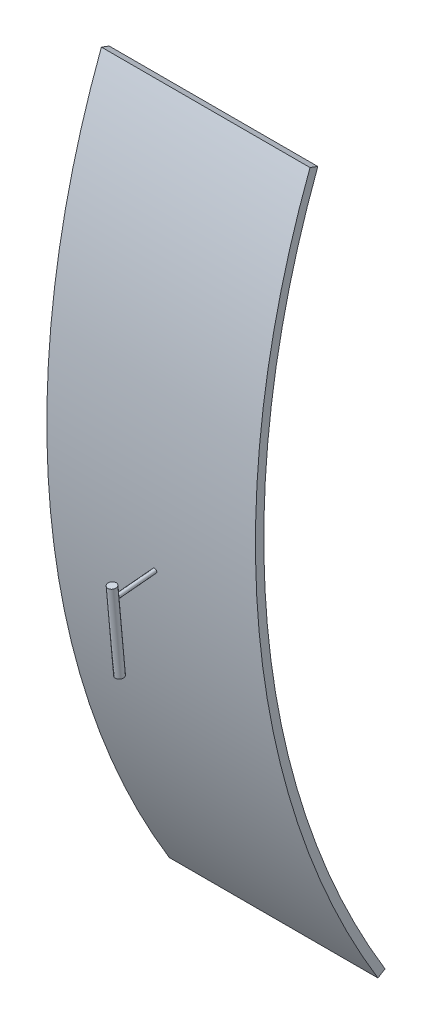
ISO-10303-21;
HEADER;
FILE_DESCRIPTION(('STEP AP214'),'2;1');
FILE_NAME('part.step','',(''),(''),'','','');
FILE_SCHEMA(('AUTOMOTIVE_DESIGN { 1 0 10303 214 1 1 1 1 }'));
ENDSEC;
DATA;
#1=APPLICATION_CONTEXT('core data for automotive mechanical design processes');
#2=APPLICATION_PROTOCOL_DEFINITION('international standard','automotive_design',2000,#1);
#3=PRODUCT_CONTEXT('',#1,'mechanical');
#4=PRODUCT('Part','Part','',(#3));
#5=PRODUCT_RELATED_PRODUCT_CATEGORY('part','',(#4));
#6=PRODUCT_DEFINITION_FORMATION('','',#4);
#7=PRODUCT_DEFINITION_CONTEXT('part definition',#1,'design');
#8=PRODUCT_DEFINITION('design','',#6,#7);
#9=PRODUCT_DEFINITION_SHAPE('','',#8);
#10=(LENGTH_UNIT() NAMED_UNIT(*) SI_UNIT(.MILLI.,.METRE.));
#11=(NAMED_UNIT(*) PLANE_ANGLE_UNIT() SI_UNIT($,.RADIAN.));
#12=(NAMED_UNIT(*) SI_UNIT($,.STERADIAN.) SOLID_ANGLE_UNIT());
#13=UNCERTAINTY_MEASURE_WITH_UNIT(LENGTH_MEASURE(1.E-05),#10,'distance_accuracy_value','');
#14=(GEOMETRIC_REPRESENTATION_CONTEXT(3) GLOBAL_UNCERTAINTY_ASSIGNED_CONTEXT((#13)) GLOBAL_UNIT_ASSIGNED_CONTEXT((#10,
#11,#12)) REPRESENTATION_CONTEXT('',''));
#15=CARTESIAN_POINT('',(0.,0.,0.));
#16=DIRECTION('',(0.,0.,1.));
#17=DIRECTION('',(1.,0.,0.));
#18=AXIS2_PLACEMENT_3D('',#15,#16,#17);
#19=CARTESIAN_POINT('',(25.,-36.1186263978189,209.567543008368));
#20=DIRECTION('',(0.,0.995768271147237,0.091899674517612));
#21=DIRECTION('',(0.,-0.091899674517612,0.995768271147237));
#22=AXIS2_PLACEMENT_3D('',#19,#20,#21);
#23=PLANE('',#22);
#24=CARTESIAN_POINT('',(25.,-36.1186263978189,209.567543008368));
#25=DIRECTION('',(0.,0.995768271147237,0.091899674517612));
#26=DIRECTION('',(0.,-0.091899674517612,0.995768271147237));
#27=AXIS2_PLACEMENT_3D('',#24,#25,#26);
#28=CIRCLE('',#27,1.);
#29=CARTESIAN_POINT('',(25.,-36.2105260723365,210.563311279516));
#30=VERTEX_POINT('',#29);
#31=EDGE_CURVE('E11',#30,#30,#28,.T.);
#32=ORIENTED_EDGE('',*,*,#31,.F.);
#33=EDGE_LOOP('',(#32));
#34=FACE_BOUND('',#33,.T.);
#35=ADVANCED_FACE('F40',(#34),#23,.F.);
#36=CARTESIAN_POINT('',(25.,-16.5421652830418,211.374258944981));
#37=DIRECTION('',(0.,0.995768271147237,0.091899674517612));
#38=DIRECTION('',(0.,-0.091899674517612,0.995768271147237));
#39=AXIS2_PLACEMENT_3D('',#36,#37,#38);
#40=CYLINDRICAL_SURFACE('',#39,0.999999999999999);
#41=CARTESIAN_POINT('',(25.,-16.5421652830418,211.374258944981));
#42=DIRECTION('',(0.,0.995768271147237,0.091899674517612));
#43=DIRECTION('',(0.,-0.091899674517612,0.995768271147237));
#44=AXIS2_PLACEMENT_3D('',#41,#42,#43);
#45=CIRCLE('',#44,0.999999999999998);
#46=CARTESIAN_POINT('',(25.,-16.6340649575594,212.370027216128));
#47=VERTEX_POINT('',#46);
#48=EDGE_CURVE('E46',#47,#47,#45,.T.);
#49=ORIENTED_EDGE('',*,*,#48,.F.);
#50=EDGE_LOOP('',(#49));
#51=FACE_BOUND('',#50,.T.);
#52=ORIENTED_EDGE('',*,*,#31,.T.);
#53=EDGE_LOOP('',(#52));
#54=FACE_BOUND('',#53,.T.);
#55=ADVANCED_FACE('F54',(#51,#54),#40,.T.);
#56=CARTESIAN_POINT('',(25.,-16.5421652830418,211.374258944981));
#57=DIRECTION('',(0.,-0.995768271147237,-0.091899674517612));
#58=DIRECTION('',(0.,0.091899674517612,-0.995768271147237));
#59=AXIS2_PLACEMENT_3D('',#56,#57,#58);
#60=PLANE('',#59);
#61=ORIENTED_EDGE('',*,*,#48,.T.);
#62=EDGE_LOOP('',(#61));
#63=FACE_BOUND('',#62,.T.);
#64=ADVANCED_FACE('F52',(#63),#60,.F.);
#65=CLOSED_SHELL('',(#35,#55,#64));
#66=MANIFOLD_SOLID_BREP('B2',#65);
#67=CARTESIAN_POINT('',(25.,-19.4827309977337,211.102873483214));
#68=DIRECTION('',(0.,0.0918996745176121,-0.995768271147237));
#69=DIRECTION('',(0.,0.995768271147237,0.0918996745176121));
#70=AXIS2_PLACEMENT_3D('',#67,#68,#69);
#71=CYLINDRICAL_SURFACE('',#70,0.5);
#72=CARTESIAN_POINT('',(25.,-19.4827309977337,211.102873483214));
#73=DIRECTION('',(0.,-0.0918996745176121,0.995768271147237));
#74=DIRECTION('',(0.,-0.995768271147237,-0.0918996745176121));
#75=AXIS2_PLACEMENT_3D('',#72,#73,#74);
#76=CIRCLE('',#75,0.5);
#77=CARTESIAN_POINT('',(25.,-19.9806151333073,211.056923645955));
#78=VERTEX_POINT('',#77);
#79=EDGE_CURVE('E39',#78,#78,#76,.T.);
#80=ORIENTED_EDGE('',*,*,#79,.F.);
#81=EDGE_LOOP('',(#80));
#82=FACE_BOUND('',#81,.T.);
#83=CARTESIAN_POINT('',(25.,-18.5637342525576,201.145190771742));
#84=DIRECTION('',(0.,-0.0918996745176121,0.995768271147237));
#85=DIRECTION('',(0.,-0.995768271147237,-0.0918996745176121));
#86=AXIS2_PLACEMENT_3D('',#83,#84,#85);
#87=CIRCLE('',#86,0.5);
#88=CARTESIAN_POINT('',(25.,-19.0616183881312,201.099240934483));
#89=VERTEX_POINT('',#88);
#90=EDGE_CURVE('E93',#89,#89,#87,.T.);
#91=ORIENTED_EDGE('',*,*,#90,.T.);
#92=EDGE_LOOP('',(#91));
#93=FACE_BOUND('',#92,.T.);
#94=ADVANCED_FACE('F90',(#82,#93),#71,.T.);
#95=CARTESIAN_POINT('',(25.,-19.4827309977337,211.102873483214));
#96=DIRECTION('',(0.,-0.0918996745176121,0.995768271147237));
#97=DIRECTION('',(0.,-0.995768271147237,-0.0918996745176121));
#98=AXIS2_PLACEMENT_3D('',#95,#96,#97);
#99=PLANE('',#98);
#100=ORIENTED_EDGE('',*,*,#79,.T.);
#101=EDGE_LOOP('',(#100));
#102=FACE_BOUND('',#101,.T.);
#103=ADVANCED_FACE('F105',(#102),#99,.T.);
#104=CARTESIAN_POINT('',(25.,-18.5637342525576,201.145190771742));
#105=DIRECTION('',(0.,-0.0918996745176121,0.995768271147237));
#106=DIRECTION('',(0.,-0.995768271147237,-0.0918996745176121));
#107=AXIS2_PLACEMENT_3D('',#104,#105,#106);
#108=PLANE('',#107);
#109=ORIENTED_EDGE('',*,*,#90,.F.);
#110=EDGE_LOOP('',(#109));
#111=FACE_BOUND('',#110,.T.);
#112=ADVANCED_FACE('F103',(#111),#108,.F.);
#113=CLOSED_SHELL('',(#94,#103,#112));
#114=MANIFOLD_SOLID_BREP('B6',#113);
#115=CARTESIAN_POINT('',(50.,0.,0.));
#116=DIRECTION('',(-1.,0.,0.));
#117=DIRECTION('',(0.,0.,1.));
#118=AXIS2_PLACEMENT_3D('',#115,#116,#117);
#119=CYLINDRICAL_SURFACE('',#118,200.);
#120=CARTESIAN_POINT('',(0.,0.,0.));
#121=DIRECTION('',(1.,0.,0.));
#122=DIRECTION('',(0.,0.,-1.));
#123=AXIS2_PLACEMENT_3D('',#120,#121,#122);
#124=CIRCLE('',#123,200.);
#125=CARTESIAN_POINT('',(0.,70.7834397291449,187.055351861716));
#126=VERTEX_POINT('',#125);
#127=CARTESIAN_POINT('',(0.,-103.822991854449,170.940885578585));
#128=VERTEX_POINT('',#127);
#129=EDGE_CURVE('E194',#126,#128,#124,.T.);
#130=ORIENTED_EDGE('',*,*,#129,.F.);
#131=DIRECTION('',(-1.,0.,0.));
#132=VECTOR('',#131,1.);
#133=CARTESIAN_POINT('',(50.,70.7834397291449,187.055351861716));
#134=LINE('',#133,#132);
#135=CARTESIAN_POINT('',(50.,70.7834397291449,187.055351861716));
#136=VERTEX_POINT('',#135);
#137=EDGE_CURVE('E88',#136,#126,#134,.T.);
#138=ORIENTED_EDGE('',*,*,#137,.F.);
#139=CARTESIAN_POINT('',(50.,0.,0.));
#140=DIRECTION('',(1.,0.,0.));
#141=DIRECTION('',(0.,0.,-1.));
#142=AXIS2_PLACEMENT_3D('',#139,#140,#141);
#143=CIRCLE('',#142,200.);
#144=CARTESIAN_POINT('',(50.,-103.822991854449,170.940885578585));
#145=VERTEX_POINT('',#144);
#146=EDGE_CURVE('E186',#136,#145,#143,.T.);
#147=ORIENTED_EDGE('',*,*,#146,.T.);
#148=DIRECTION('',(-1.,0.,0.));
#149=VECTOR('',#148,1.);
#150=CARTESIAN_POINT('',(50.,-103.822991854449,170.940885578585));
#151=LINE('',#150,#149);
#152=EDGE_CURVE('E134',#145,#128,#151,.T.);
#153=ORIENTED_EDGE('',*,*,#152,.T.);
#154=EDGE_LOOP('',(#130,#138,#147,#153));
#155=FACE_BOUND('',#154,.T.);
#156=ADVANCED_FACE('F131',(#155),#119,.F.);
#157=CARTESIAN_POINT('',(50.,71.4912741264364,188.925905380333));
#158=DIRECTION('',(0.,0.935276759308582,-0.353917198645724));
#159=DIRECTION('',(0.,0.353917198645724,0.935276759308582));
#160=AXIS2_PLACEMENT_3D('',#157,#158,#159);
#161=PLANE('',#160);
#162=DIRECTION('',(0.,-0.353917198645724,-0.935276759308582));
#163=VECTOR('',#162,1.);
#164=CARTESIAN_POINT('',(0.,71.4912741264364,188.925905380333));
#165=LINE('',#164,#163);
#166=CARTESIAN_POINT('',(0.,71.4912741264364,188.925905380333));
#167=VERTEX_POINT('',#166);
#168=EDGE_CURVE('E200',#167,#126,#165,.T.);
#169=ORIENTED_EDGE('',*,*,#168,.F.);
#170=DIRECTION('',(-1.,0.,0.));
#171=VECTOR('',#170,1.);
#172=CARTESIAN_POINT('',(50.,71.4912741264364,188.925905380333));
#173=LINE('',#172,#171);
#174=CARTESIAN_POINT('',(50.,71.4912741264364,188.925905380333));
#175=VERTEX_POINT('',#174);
#176=EDGE_CURVE('E140',#175,#167,#173,.T.);
#177=ORIENTED_EDGE('',*,*,#176,.F.);
#178=DIRECTION('',(0.,-0.353917198645724,-0.935276759308582));
#179=VECTOR('',#178,1.);
#180=CARTESIAN_POINT('',(50.,71.4912741264364,188.925905380333));
#181=LINE('',#180,#179);
#182=EDGE_CURVE('E189',#175,#136,#181,.T.);
#183=ORIENTED_EDGE('',*,*,#182,.T.);
#184=ORIENTED_EDGE('',*,*,#137,.T.);
#185=EDGE_LOOP('',(#169,#177,#183,#184));
#186=FACE_BOUND('',#185,.T.);
#187=ADVANCED_FACE('F204',(#186),#161,.T.);
#188=CARTESIAN_POINT('',(50.,0.,0.));
#189=DIRECTION('',(-1.,0.,0.));
#190=DIRECTION('',(0.,0.,1.));
#191=AXIS2_PLACEMENT_3D('',#188,#189,#190);
#192=CYLINDRICAL_SURFACE('',#191,202.);
#193=CARTESIAN_POINT('',(0.,0.,0.));
#194=DIRECTION('',(-1.,0.,0.));
#195=DIRECTION('',(0.,0.,1.));
#196=AXIS2_PLACEMENT_3D('',#193,#194,#195);
#197=CIRCLE('',#196,202.);
#198=CARTESIAN_POINT('',(0.,-104.861221772994,172.650294434371));
#199=VERTEX_POINT('',#198);
#200=EDGE_CURVE('E181',#199,#167,#197,.T.);
#201=ORIENTED_EDGE('',*,*,#200,.F.);
#202=DIRECTION('',(-1.,0.,0.));
#203=VECTOR('',#202,1.);
#204=CARTESIAN_POINT('',(50.,-104.861221772994,172.650294434371));
#205=LINE('',#204,#203);
#206=CARTESIAN_POINT('',(50.,-104.861221772994,172.650294434371));
#207=VERTEX_POINT('',#206);
#208=EDGE_CURVE('E177',#207,#199,#205,.T.);
#209=ORIENTED_EDGE('',*,*,#208,.F.);
#210=CARTESIAN_POINT('',(50.,0.,0.));
#211=DIRECTION('',(-1.,0.,0.));
#212=DIRECTION('',(0.,0.,1.));
#213=AXIS2_PLACEMENT_3D('',#210,#211,#212);
#214=CIRCLE('',#213,202.);
#215=EDGE_CURVE('E179',#207,#175,#214,.T.);
#216=ORIENTED_EDGE('',*,*,#215,.T.);
#217=ORIENTED_EDGE('',*,*,#176,.T.);
#218=EDGE_LOOP('',(#201,#209,#216,#217));
#219=FACE_BOUND('',#218,.T.);
#220=ADVANCED_FACE('F178',(#219),#192,.T.);
#221=CARTESIAN_POINT('',(50.,-104.861221772994,172.650294434371));
#222=DIRECTION('',(0.,0.854704427892926,0.519114959272247));
#223=DIRECTION('',(0.,-0.519114959272247,0.854704427892926));
#224=AXIS2_PLACEMENT_3D('',#221,#222,#223);
#225=PLANE('',#224);
#226=DIRECTION('',(0.,0.519114959272247,-0.854704427892926));
#227=VECTOR('',#226,1.);
#228=CARTESIAN_POINT('',(0.,-104.861221772994,172.650294434371));
#229=LINE('',#228,#227);
#230=EDGE_CURVE('E197',#199,#128,#229,.T.);
#231=ORIENTED_EDGE('',*,*,#230,.T.);
#232=ORIENTED_EDGE('',*,*,#152,.F.);
#233=DIRECTION('',(0.,0.519114959272247,-0.854704427892926));
#234=VECTOR('',#233,1.);
#235=CARTESIAN_POINT('',(50.,-104.861221772994,172.650294434371));
#236=LINE('',#235,#234);
#237=EDGE_CURVE('E174',#207,#145,#236,.T.);
#238=ORIENTED_EDGE('',*,*,#237,.F.);
#239=ORIENTED_EDGE('',*,*,#208,.T.);
#240=EDGE_LOOP('',(#231,#232,#238,#239));
#241=FACE_BOUND('',#240,.T.);
#242=ADVANCED_FACE('F185',(#241),#225,.F.);
#243=CARTESIAN_POINT('',(50.,0.,0.));
#244=DIRECTION('',(1.,0.,0.));
#245=DIRECTION('',(0.,0.,-1.));
#246=AXIS2_PLACEMENT_3D('',#243,#244,#245);
#247=PLANE('',#246);
#248=ORIENTED_EDGE('',*,*,#146,.F.);
#249=ORIENTED_EDGE('',*,*,#182,.F.);
#250=ORIENTED_EDGE('',*,*,#215,.F.);
#251=ORIENTED_EDGE('',*,*,#237,.T.);
#252=EDGE_LOOP('',(#248,#249,#250,#251));
#253=FACE_BOUND('',#252,.T.);
#254=ADVANCED_FACE('F188',(#253),#247,.T.);
#255=CARTESIAN_POINT('',(0.,0.,0.));
#256=DIRECTION('',(1.,0.,0.));
#257=DIRECTION('',(0.,0.,-1.));
#258=AXIS2_PLACEMENT_3D('',#255,#256,#257);
#259=PLANE('',#258);
#260=ORIENTED_EDGE('',*,*,#129,.T.);
#261=ORIENTED_EDGE('',*,*,#230,.F.);
#262=ORIENTED_EDGE('',*,*,#200,.T.);
#263=ORIENTED_EDGE('',*,*,#168,.T.);
#264=EDGE_LOOP('',(#260,#261,#262,#263));
#265=FACE_BOUND('',#264,.T.);
#266=ADVANCED_FACE('F213',(#265),#259,.F.);
#267=CLOSED_SHELL('',(#156,#187,#220,#242,#254,#266));
#268=MANIFOLD_SOLID_BREP('B34',#267);
#269=ADVANCED_BREP_SHAPE_REPRESENTATION('',(#18,#66,#114,#268),#14);
#270=SHAPE_DEFINITION_REPRESENTATION(#9,#269);
ENDSEC;
END-ISO-10303-21;
